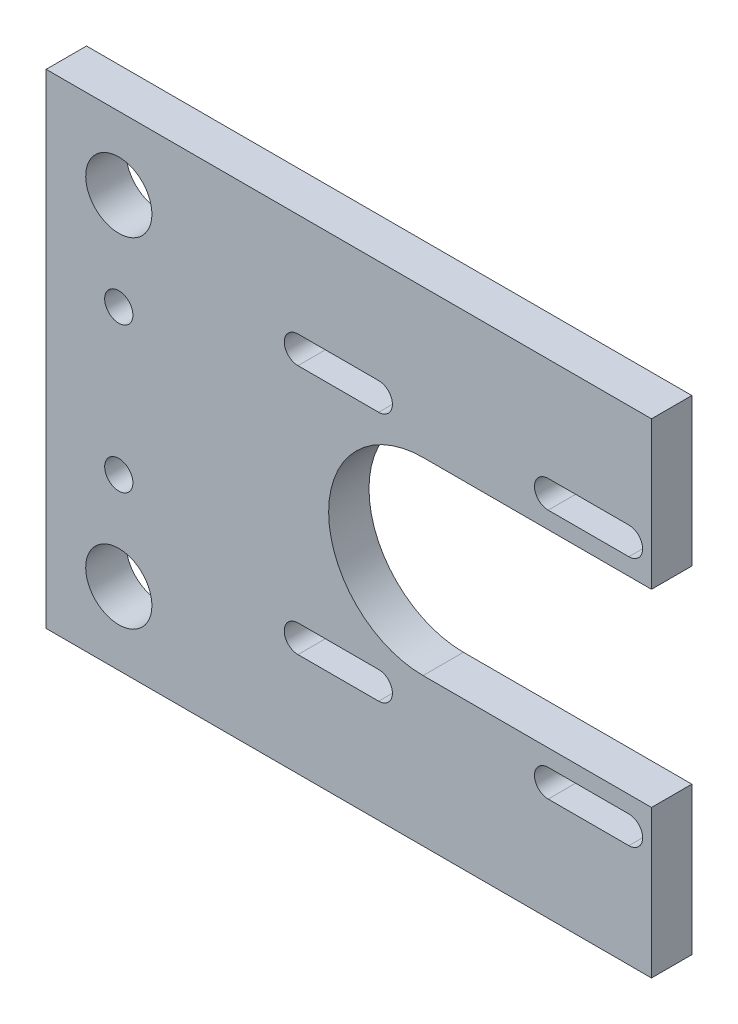
ISO-10303-21;
HEADER;
FILE_DESCRIPTION(('STEP AP214'),'2;1');
FILE_NAME('part.step','',(''),(''),'','','');
FILE_SCHEMA(('AUTOMOTIVE_DESIGN { 1 0 10303 214 1 1 1 1 }'));
ENDSEC;
DATA;
#1=APPLICATION_CONTEXT('core data for automotive mechanical design processes');
#2=APPLICATION_PROTOCOL_DEFINITION('international standard','automotive_design',2000,#1);
#3=PRODUCT_CONTEXT('',#1,'mechanical');
#4=PRODUCT('Part','Part','',(#3));
#5=PRODUCT_RELATED_PRODUCT_CATEGORY('part','',(#4));
#6=PRODUCT_DEFINITION_FORMATION('','',#4);
#7=PRODUCT_DEFINITION_CONTEXT('part definition',#1,'design');
#8=PRODUCT_DEFINITION('design','',#6,#7);
#9=PRODUCT_DEFINITION_SHAPE('','',#8);
#10=(LENGTH_UNIT() NAMED_UNIT(*) SI_UNIT(.MILLI.,.METRE.));
#11=(NAMED_UNIT(*) PLANE_ANGLE_UNIT() SI_UNIT($,.RADIAN.));
#12=(NAMED_UNIT(*) SI_UNIT($,.STERADIAN.) SOLID_ANGLE_UNIT());
#13=UNCERTAINTY_MEASURE_WITH_UNIT(LENGTH_MEASURE(1.E-05),#10,'distance_accuracy_value','');
#14=(GEOMETRIC_REPRESENTATION_CONTEXT(3) GLOBAL_UNCERTAINTY_ASSIGNED_CONTEXT((#13)) GLOBAL_UNIT_ASSIGNED_CONTEXT((#10,
#11,#12)) REPRESENTATION_CONTEXT('',''));
#15=CARTESIAN_POINT('',(0.,0.,0.));
#16=DIRECTION('',(0.,0.,1.));
#17=DIRECTION('',(1.,0.,0.));
#18=AXIS2_PLACEMENT_3D('',#15,#16,#17);
#19=CARTESIAN_POINT('',(55.,-31.7446168534772,38.6073043374941));
#20=DIRECTION('',(1.,0.,0.));
#21=DIRECTION('',(0.,0.,-1.));
#22=AXIS2_PLACEMENT_3D('',#19,#20,#21);
#23=PLANE('',#22);
#24=DIRECTION('',(0.,0.,-1.));
#25=VECTOR('',#24,1.);
#26=CARTESIAN_POINT('',(55.,-13.4446168534772,38.6073043374941));
#27=LINE('',#26,#25);
#28=CARTESIAN_POINT('',(55.,-13.4446168534772,38.6073043374942));
#29=VERTEX_POINT('',#28);
#30=CARTESIAN_POINT('',(55.,-13.4446168534772,33.6073043374942));
#31=VERTEX_POINT('',#30);
#32=EDGE_CURVE('E11',#29,#31,#27,.T.);
#33=ORIENTED_EDGE('',*,*,#32,.F.);
#34=DIRECTION('',(0.,-1.,0.));
#35=VECTOR('',#34,1.);
#36=CARTESIAN_POINT('',(55.,28.2553831465228,38.6073043374942));
#37=LINE('',#36,#35);
#38=CARTESIAN_POINT('',(55.,-31.7446168534772,38.6073043374941));
#39=VERTEX_POINT('',#38);
#40=EDGE_CURVE('E377',#29,#39,#37,.T.);
#41=ORIENTED_EDGE('',*,*,#40,.T.);
#42=DIRECTION('',(0.,0.,-1.));
#43=VECTOR('',#42,1.);
#44=CARTESIAN_POINT('',(55.,-31.7446168534772,38.6073043374941));
#45=LINE('',#44,#43);
#46=CARTESIAN_POINT('',(55.,-31.7446168534772,33.6073043374941));
#47=VERTEX_POINT('',#46);
#48=EDGE_CURVE('E382',#39,#47,#45,.T.);
#49=ORIENTED_EDGE('',*,*,#48,.T.);
#50=DIRECTION('',(0.,1.,0.));
#51=VECTOR('',#50,1.);
#52=CARTESIAN_POINT('',(55.,28.2553831465228,33.6073043374941));
#53=LINE('',#52,#51);
#54=EDGE_CURVE('E204',#47,#31,#53,.T.);
#55=ORIENTED_EDGE('',*,*,#54,.T.);
#56=EDGE_LOOP('',(#33,#41,#49,#55));
#57=FACE_BOUND('',#56,.T.);
#58=ADVANCED_FACE('F35',(#57),#23,.T.);
#59=CARTESIAN_POINT('',(5.,28.2553831465228,38.6073043374942));
#60=DIRECTION('',(0.,0.,-1.));
#61=DIRECTION('',(0.,1.,0.));
#62=AXIS2_PLACEMENT_3D('',#59,#60,#61);
#63=PLANE('',#62);
#64=CARTESIAN_POINT('',(-11.,7.25538314652282,38.6073043374942));
#65=DIRECTION('',(0.,0.,-1.));
#66=DIRECTION('',(0.,1.,0.));
#67=AXIS2_PLACEMENT_3D('',#64,#65,#66);
#68=CIRCLE('',#67,1.75);
#69=CARTESIAN_POINT('',(-11.,9.00538314652282,38.6073043374942));
#70=VERTEX_POINT('',#69);
#71=EDGE_CURVE('E719',#70,#70,#68,.T.);
#72=ORIENTED_EDGE('',*,*,#71,.T.);
#73=EDGE_LOOP('',(#72));
#74=FACE_BOUND('',#73,.T.);
#75=CARTESIAN_POINT('',(-11.,-10.7446168534772,38.6073043374942));
#76=DIRECTION('',(0.,0.,-1.));
#77=DIRECTION('',(0.,1.,0.));
#78=AXIS2_PLACEMENT_3D('',#75,#76,#77);
#79=CIRCLE('',#78,1.75);
#80=CARTESIAN_POINT('',(-11.,-8.99461685347718,38.6073043374942));
#81=VERTEX_POINT('',#80);
#82=EDGE_CURVE('E727',#81,#81,#79,.T.);
#83=ORIENTED_EDGE('',*,*,#82,.T.);
#84=EDGE_LOOP('',(#83));
#85=FACE_BOUND('',#84,.T.);
#86=CARTESIAN_POINT('',(-11.,-22.7446168534772,38.6073043374942));
#87=DIRECTION('',(0.,0.,-1.));
#88=DIRECTION('',(0.,1.,0.));
#89=AXIS2_PLACEMENT_3D('',#86,#87,#88);
#90=CIRCLE('',#89,4.1);
#91=CARTESIAN_POINT('',(-11.,-18.6446168534772,38.6073043374942));
#92=VERTEX_POINT('',#91);
#93=EDGE_CURVE('E733',#92,#92,#90,.T.);
#94=ORIENTED_EDGE('',*,*,#93,.T.);
#95=EDGE_LOOP('',(#94));
#96=FACE_BOUND('',#95,.T.);
#97=CARTESIAN_POINT('',(-11.,19.2553831465228,38.6073043374942));
#98=DIRECTION('',(0.,0.,-1.));
#99=DIRECTION('',(0.,1.,0.));
#100=AXIS2_PLACEMENT_3D('',#97,#98,#99);
#101=CIRCLE('',#100,4.1);
#102=CARTESIAN_POINT('',(-11.,23.3553831465228,38.6073043374942));
#103=VERTEX_POINT('',#102);
#104=EDGE_CURVE('E224',#103,#103,#101,.T.);
#105=ORIENTED_EDGE('',*,*,#104,.T.);
#106=EDGE_LOOP('',(#105));
#107=FACE_BOUND('',#106,.T.);
#108=DIRECTION('',(-1.,0.,0.));
#109=VECTOR('',#108,1.);
#110=CARTESIAN_POINT('',(11.2,12.0553831465228,38.6073043374942));
#111=LINE('',#110,#109);
#112=CARTESIAN_POINT('',(21.2,12.0553831465228,38.6073043374942));
#113=VERTEX_POINT('',#112);
#114=CARTESIAN_POINT('',(11.2,12.0553831465228,38.6073043374942));
#115=VERTEX_POINT('',#114);
#116=EDGE_CURVE('E241',#113,#115,#111,.T.);
#117=ORIENTED_EDGE('',*,*,#116,.T.);
#118=CARTESIAN_POINT('',(11.2,13.7553831465228,38.6073043374942));
#119=DIRECTION('',(0.,0.,-1.));
#120=DIRECTION('',(-1.,0.,0.));
#121=AXIS2_PLACEMENT_3D('',#118,#119,#120);
#122=CIRCLE('',#121,1.7);
#123=CARTESIAN_POINT('',(11.2,15.4553831465228,38.6073043374942));
#124=VERTEX_POINT('',#123);
#125=EDGE_CURVE('E233',#115,#124,#122,.T.);
#126=ORIENTED_EDGE('',*,*,#125,.T.);
#127=DIRECTION('',(1.,0.,0.));
#128=VECTOR('',#127,1.);
#129=CARTESIAN_POINT('',(11.2,15.4553831465228,38.6073043374942));
#130=LINE('',#129,#128);
#131=CARTESIAN_POINT('',(21.2,15.4553831465228,38.6073043374942));
#132=VERTEX_POINT('',#131);
#133=EDGE_CURVE('E236',#124,#132,#130,.T.);
#134=ORIENTED_EDGE('',*,*,#133,.T.);
#135=CARTESIAN_POINT('',(21.2,13.7553831465228,38.6073043374942));
#136=DIRECTION('',(0.,0.,-1.));
#137=DIRECTION('',(-1.,0.,0.));
#138=AXIS2_PLACEMENT_3D('',#135,#136,#137);
#139=CIRCLE('',#138,1.7);
#140=EDGE_CURVE('E50',#132,#113,#139,.T.);
#141=ORIENTED_EDGE('',*,*,#140,.T.);
#142=EDGE_LOOP('',(#117,#126,#134,#141));
#143=FACE_BOUND('',#142,.T.);
#144=DIRECTION('',(-1.,0.,0.));
#145=VECTOR('',#144,1.);
#146=CARTESIAN_POINT('',(11.2,-18.9446168534772,38.6073043374942));
#147=LINE('',#146,#145);
#148=CARTESIAN_POINT('',(21.2,-18.9446168534772,38.6073043374942));
#149=VERTEX_POINT('',#148);
#150=CARTESIAN_POINT('',(11.2,-18.9446168534772,38.6073043374942));
#151=VERTEX_POINT('',#150);
#152=EDGE_CURVE('E272',#149,#151,#147,.T.);
#153=ORIENTED_EDGE('',*,*,#152,.T.);
#154=CARTESIAN_POINT('',(11.2,-17.2446168534772,38.6073043374942));
#155=DIRECTION('',(0.,0.,-1.));
#156=DIRECTION('',(-1.,0.,0.));
#157=AXIS2_PLACEMENT_3D('',#154,#155,#156);
#158=CIRCLE('',#157,1.69999999999999);
#159=CARTESIAN_POINT('',(11.2,-15.5446168534772,38.6073043374942));
#160=VERTEX_POINT('',#159);
#161=EDGE_CURVE('E262',#151,#160,#158,.T.);
#162=ORIENTED_EDGE('',*,*,#161,.T.);
#163=DIRECTION('',(1.,0.,0.));
#164=VECTOR('',#163,1.);
#165=CARTESIAN_POINT('',(11.2,-15.5446168534772,38.6073043374942));
#166=LINE('',#165,#164);
#167=CARTESIAN_POINT('',(21.2,-15.5446168534772,38.6073043374941));
#168=VERTEX_POINT('',#167);
#169=EDGE_CURVE('E265',#160,#168,#166,.T.);
#170=ORIENTED_EDGE('',*,*,#169,.T.);
#171=CARTESIAN_POINT('',(21.2,-17.2446168534772,38.6073043374942));
#172=DIRECTION('',(0.,0.,-1.));
#173=DIRECTION('',(-1.,0.,0.));
#174=AXIS2_PLACEMENT_3D('',#171,#172,#173);
#175=CIRCLE('',#174,1.69999999999999);
#176=EDGE_CURVE('E269',#168,#149,#175,.T.);
#177=ORIENTED_EDGE('',*,*,#176,.T.);
#178=EDGE_LOOP('',(#153,#162,#170,#177));
#179=FACE_BOUND('',#178,.T.);
#180=DIRECTION('',(-1.,0.,0.));
#181=VECTOR('',#180,1.);
#182=CARTESIAN_POINT('',(42.2,-18.9446168534772,38.6073043374942));
#183=LINE('',#182,#181);
#184=CARTESIAN_POINT('',(52.2,-18.9446168534772,38.6073043374942));
#185=VERTEX_POINT('',#184);
#186=CARTESIAN_POINT('',(42.2,-18.9446168534772,38.6073043374942));
#187=VERTEX_POINT('',#186);
#188=EDGE_CURVE('E304',#185,#187,#183,.T.);
#189=ORIENTED_EDGE('',*,*,#188,.T.);
#190=CARTESIAN_POINT('',(42.2,-17.2446168534772,38.6073043374942));
#191=DIRECTION('',(0.,0.,-1.));
#192=DIRECTION('',(-1.,0.,0.));
#193=AXIS2_PLACEMENT_3D('',#190,#191,#192);
#194=CIRCLE('',#193,1.7);
#195=CARTESIAN_POINT('',(42.2,-15.5446168534772,38.6073043374942));
#196=VERTEX_POINT('',#195);
#197=EDGE_CURVE('E294',#187,#196,#194,.T.);
#198=ORIENTED_EDGE('',*,*,#197,.T.);
#199=DIRECTION('',(1.,0.,0.));
#200=VECTOR('',#199,1.);
#201=CARTESIAN_POINT('',(42.2,-15.5446168534772,38.6073043374942));
#202=LINE('',#201,#200);
#203=CARTESIAN_POINT('',(52.2,-15.5446168534772,38.6073043374941));
#204=VERTEX_POINT('',#203);
#205=EDGE_CURVE('E297',#196,#204,#202,.T.);
#206=ORIENTED_EDGE('',*,*,#205,.T.);
#207=CARTESIAN_POINT('',(52.2,-17.2446168534772,38.6073043374942));
#208=DIRECTION('',(0.,0.,-1.));
#209=DIRECTION('',(-1.,0.,0.));
#210=AXIS2_PLACEMENT_3D('',#207,#208,#209);
#211=CIRCLE('',#210,1.7);
#212=EDGE_CURVE('E301',#204,#185,#211,.T.);
#213=ORIENTED_EDGE('',*,*,#212,.T.);
#214=EDGE_LOOP('',(#189,#198,#206,#213));
#215=FACE_BOUND('',#214,.T.);
#216=DIRECTION('',(-1.,0.,0.));
#217=VECTOR('',#216,1.);
#218=CARTESIAN_POINT('',(42.2,12.0553831465228,38.6073043374942));
#219=LINE('',#218,#217);
#220=CARTESIAN_POINT('',(52.2,12.0553831465228,38.6073043374942));
#221=VERTEX_POINT('',#220);
#222=CARTESIAN_POINT('',(42.2,12.0553831465228,38.6073043374942));
#223=VERTEX_POINT('',#222);
#224=EDGE_CURVE('E336',#221,#223,#219,.T.);
#225=ORIENTED_EDGE('',*,*,#224,.T.);
#226=CARTESIAN_POINT('',(42.2,13.7553831465228,38.6073043374942));
#227=DIRECTION('',(0.,0.,-1.));
#228=DIRECTION('',(-1.,0.,0.));
#229=AXIS2_PLACEMENT_3D('',#226,#227,#228);
#230=CIRCLE('',#229,1.7);
#231=CARTESIAN_POINT('',(42.2,15.4553831465228,38.6073043374942));
#232=VERTEX_POINT('',#231);
#233=EDGE_CURVE('E326',#223,#232,#230,.T.);
#234=ORIENTED_EDGE('',*,*,#233,.T.);
#235=DIRECTION('',(1.,0.,0.));
#236=VECTOR('',#235,1.);
#237=CARTESIAN_POINT('',(42.2,15.4553831465228,38.6073043374942));
#238=LINE('',#237,#236);
#239=CARTESIAN_POINT('',(52.2,15.4553831465228,38.6073043374942));
#240=VERTEX_POINT('',#239);
#241=EDGE_CURVE('E329',#232,#240,#238,.T.);
#242=ORIENTED_EDGE('',*,*,#241,.T.);
#243=CARTESIAN_POINT('',(52.2,13.7553831465228,38.6073043374942));
#244=DIRECTION('',(0.,0.,-1.));
#245=DIRECTION('',(-1.,0.,0.));
#246=AXIS2_PLACEMENT_3D('',#243,#244,#245);
#247=CIRCLE('',#246,1.69999999999999);
#248=EDGE_CURVE('E333',#240,#221,#247,.T.);
#249=ORIENTED_EDGE('',*,*,#248,.T.);
#250=EDGE_LOOP('',(#225,#234,#242,#249));
#251=FACE_BOUND('',#250,.T.);
#252=ORIENTED_EDGE('',*,*,#40,.F.);
#253=DIRECTION('',(-1.,0.,0.));
#254=VECTOR('',#253,1.);
#255=CARTESIAN_POINT('',(26.7,-13.4446168534772,38.6073043374942));
#256=LINE('',#255,#254);
#257=CARTESIAN_POINT('',(26.7,-13.4446168534772,38.6073043374942));
#258=VERTEX_POINT('',#257);
#259=EDGE_CURVE('E365',#29,#258,#256,.T.);
#260=ORIENTED_EDGE('',*,*,#259,.T.);
#261=CARTESIAN_POINT('',(26.7,-1.74461685347718,38.6073043374942));
#262=DIRECTION('',(0.,0.,-1.));
#263=DIRECTION('',(-1.,0.,0.));
#264=AXIS2_PLACEMENT_3D('',#261,#262,#263);
#265=CIRCLE('',#264,11.7);
#266=CARTESIAN_POINT('',(26.7,9.95538314652282,38.6073043374942));
#267=VERTEX_POINT('',#266);
#268=EDGE_CURVE('E358',#258,#267,#265,.T.);
#269=ORIENTED_EDGE('',*,*,#268,.T.);
#270=DIRECTION('',(1.,0.,0.));
#271=VECTOR('',#270,1.);
#272=CARTESIAN_POINT('',(26.7,9.95538314652282,38.6073043374942));
#273=LINE('',#272,#271);
#274=CARTESIAN_POINT('',(55.,9.95538314652282,38.6073043374942));
#275=VERTEX_POINT('',#274);
#276=EDGE_CURVE('E361',#267,#275,#273,.T.);
#277=ORIENTED_EDGE('',*,*,#276,.T.);
#278=CARTESIAN_POINT('',(55.,28.2553831465228,38.6073043374942));
#279=VERTEX_POINT('',#278);
#280=EDGE_CURVE('E379',#279,#275,#37,.T.);
#281=ORIENTED_EDGE('',*,*,#280,.F.);
#282=DIRECTION('',(-1.,0.,0.));
#283=VECTOR('',#282,1.);
#284=CARTESIAN_POINT('',(5.,28.2553831465228,38.6073043374942));
#285=LINE('',#284,#283);
#286=CARTESIAN_POINT('',(-20.,28.2553831465228,38.6073043374941));
#287=VERTEX_POINT('',#286);
#288=EDGE_CURVE('E389',#279,#287,#285,.T.);
#289=ORIENTED_EDGE('',*,*,#288,.T.);
#290=DIRECTION('',(0.,1.,0.));
#291=VECTOR('',#290,1.);
#292=CARTESIAN_POINT('',(-20.,28.2553831465228,38.6073043374941));
#293=LINE('',#292,#291);
#294=CARTESIAN_POINT('',(-20.,-31.7446168534772,38.6073043374941));
#295=VERTEX_POINT('',#294);
#296=EDGE_CURVE('E218',#295,#287,#293,.T.);
#297=ORIENTED_EDGE('',*,*,#296,.F.);
#298=DIRECTION('',(-1.,0.,0.));
#299=VECTOR('',#298,1.);
#300=CARTESIAN_POINT('',(5.,-31.7446168534772,38.6073043374941));
#301=LINE('',#300,#299);
#302=EDGE_CURVE('E208',#39,#295,#301,.T.);
#303=ORIENTED_EDGE('',*,*,#302,.F.);
#304=EDGE_LOOP('',(#252,#260,#269,#277,#281,#289,#297,#303));
#305=FACE_BOUND('',#304,.T.);
#306=ADVANCED_FACE('F37',(#74,#85,#96,#107,#143,#179,#215,#251,#305),#63,.F.);
#307=CARTESIAN_POINT('',(5.,-31.7446168534772,38.6073043374941));
#308=DIRECTION('',(0.,1.,0.));
#309=DIRECTION('',(0.,0.,1.));
#310=AXIS2_PLACEMENT_3D('',#307,#308,#309);
#311=PLANE('',#310);
#312=ORIENTED_EDGE('',*,*,#302,.T.);
#313=DIRECTION('',(0.,0.,1.));
#314=VECTOR('',#313,1.);
#315=CARTESIAN_POINT('',(-20.,-31.7446168534772,33.6073043374942));
#316=LINE('',#315,#314);
#317=CARTESIAN_POINT('',(-20.,-31.7446168534772,33.6073043374942));
#318=VERTEX_POINT('',#317);
#319=EDGE_CURVE('E212',#318,#295,#316,.T.);
#320=ORIENTED_EDGE('',*,*,#319,.F.);
#321=DIRECTION('',(-1.,0.,0.));
#322=VECTOR('',#321,1.);
#323=CARTESIAN_POINT('',(5.,-31.7446168534772,33.6073043374941));
#324=LINE('',#323,#322);
#325=EDGE_CURVE('E195',#47,#318,#324,.T.);
#326=ORIENTED_EDGE('',*,*,#325,.F.);
#327=ORIENTED_EDGE('',*,*,#48,.F.);
#328=EDGE_LOOP('',(#312,#320,#326,#327));
#329=FACE_BOUND('',#328,.T.);
#330=ADVANCED_FACE('F213',(#329),#311,.F.);
#331=CARTESIAN_POINT('',(5.,28.2553831465228,33.6073043374942));
#332=DIRECTION('',(0.,0.,1.));
#333=DIRECTION('',(0.,-1.,0.));
#334=AXIS2_PLACEMENT_3D('',#331,#332,#333);
#335=PLANE('',#334);
#336=CARTESIAN_POINT('',(-11.,7.25538314652282,33.6073043374942));
#337=DIRECTION('',(0.,0.,-1.));
#338=DIRECTION('',(0.,1.,0.));
#339=AXIS2_PLACEMENT_3D('',#336,#337,#338);
#340=CIRCLE('',#339,1.75);
#341=CARTESIAN_POINT('',(-11.,9.00538314652282,33.6073043374942));
#342=VERTEX_POINT('',#341);
#343=EDGE_CURVE('E722',#342,#342,#340,.T.);
#344=ORIENTED_EDGE('',*,*,#343,.F.);
#345=EDGE_LOOP('',(#344));
#346=FACE_BOUND('',#345,.T.);
#347=CARTESIAN_POINT('',(-11.,-10.7446168534772,33.6073043374942));
#348=DIRECTION('',(0.,0.,-1.));
#349=DIRECTION('',(0.,1.,0.));
#350=AXIS2_PLACEMENT_3D('',#347,#348,#349);
#351=CIRCLE('',#350,1.75);
#352=CARTESIAN_POINT('',(-11.,-8.99461685347718,33.6073043374942));
#353=VERTEX_POINT('',#352);
#354=EDGE_CURVE('E724',#353,#353,#351,.T.);
#355=ORIENTED_EDGE('',*,*,#354,.F.);
#356=EDGE_LOOP('',(#355));
#357=FACE_BOUND('',#356,.T.);
#358=CARTESIAN_POINT('',(-11.,-22.7446168534772,33.6073043374942));
#359=DIRECTION('',(0.,0.,-1.));
#360=DIRECTION('',(0.,1.,0.));
#361=AXIS2_PLACEMENT_3D('',#358,#359,#360);
#362=CIRCLE('',#361,4.1);
#363=CARTESIAN_POINT('',(-11.,-18.6446168534772,33.6073043374942));
#364=VERTEX_POINT('',#363);
#365=EDGE_CURVE('E730',#364,#364,#362,.T.);
#366=ORIENTED_EDGE('',*,*,#365,.F.);
#367=EDGE_LOOP('',(#366));
#368=FACE_BOUND('',#367,.T.);
#369=CARTESIAN_POINT('',(-11.,19.2553831465228,33.6073043374942));
#370=DIRECTION('',(0.,0.,-1.));
#371=DIRECTION('',(0.,1.,0.));
#372=AXIS2_PLACEMENT_3D('',#369,#370,#371);
#373=CIRCLE('',#372,4.1);
#374=CARTESIAN_POINT('',(-11.,23.3553831465228,33.6073043374942));
#375=VERTEX_POINT('',#374);
#376=EDGE_CURVE('E227',#375,#375,#373,.T.);
#377=ORIENTED_EDGE('',*,*,#376,.F.);
#378=EDGE_LOOP('',(#377));
#379=FACE_BOUND('',#378,.T.);
#380=DIRECTION('',(1.,0.,0.));
#381=VECTOR('',#380,1.);
#382=CARTESIAN_POINT('',(11.2,15.4553831465228,33.6073043374942));
#383=LINE('',#382,#381);
#384=CARTESIAN_POINT('',(11.2,15.4553831465228,33.6073043374942));
#385=VERTEX_POINT('',#384);
#386=CARTESIAN_POINT('',(21.2,15.4553831465228,33.6073043374942));
#387=VERTEX_POINT('',#386);
#388=EDGE_CURVE('E246',#385,#387,#383,.T.);
#389=ORIENTED_EDGE('',*,*,#388,.F.);
#390=CARTESIAN_POINT('',(11.2,13.7553831465228,33.6073043374942));
#391=DIRECTION('',(0.,0.,-1.));
#392=DIRECTION('',(-1.,0.,0.));
#393=AXIS2_PLACEMENT_3D('',#390,#391,#392);
#394=CIRCLE('',#393,1.7);
#395=CARTESIAN_POINT('',(11.2,12.0553831465228,33.6073043374942));
#396=VERTEX_POINT('',#395);
#397=EDGE_CURVE('E58',#396,#385,#394,.T.);
#398=ORIENTED_EDGE('',*,*,#397,.F.);
#399=DIRECTION('',(-1.,0.,0.));
#400=VECTOR('',#399,1.);
#401=CARTESIAN_POINT('',(11.2,12.0553831465228,33.6073043374942));
#402=LINE('',#401,#400);
#403=CARTESIAN_POINT('',(21.2,12.0553831465228,33.6073043374942));
#404=VERTEX_POINT('',#403);
#405=EDGE_CURVE('E237',#404,#396,#402,.T.);
#406=ORIENTED_EDGE('',*,*,#405,.F.);
#407=CARTESIAN_POINT('',(21.2,13.7553831465228,33.6073043374942));
#408=DIRECTION('',(0.,0.,-1.));
#409=DIRECTION('',(-1.,0.,0.));
#410=AXIS2_PLACEMENT_3D('',#407,#408,#409);
#411=CIRCLE('',#410,1.7);
#412=EDGE_CURVE('E249',#387,#404,#411,.T.);
#413=ORIENTED_EDGE('',*,*,#412,.F.);
#414=EDGE_LOOP('',(#389,#398,#406,#413));
#415=FACE_BOUND('',#414,.T.);
#416=DIRECTION('',(1.,0.,0.));
#417=VECTOR('',#416,1.);
#418=CARTESIAN_POINT('',(11.2,-15.5446168534772,33.6073043374942));
#419=LINE('',#418,#417);
#420=CARTESIAN_POINT('',(11.2,-15.5446168534772,33.6073043374941));
#421=VERTEX_POINT('',#420);
#422=CARTESIAN_POINT('',(21.2,-15.5446168534772,33.6073043374942));
#423=VERTEX_POINT('',#422);
#424=EDGE_CURVE('E277',#421,#423,#419,.T.);
#425=ORIENTED_EDGE('',*,*,#424,.F.);
#426=CARTESIAN_POINT('',(11.2,-17.2446168534772,33.6073043374942));
#427=DIRECTION('',(0.,0.,-1.));
#428=DIRECTION('',(-1.,0.,0.));
#429=AXIS2_PLACEMENT_3D('',#426,#427,#428);
#430=CIRCLE('',#429,1.69999999999999);
#431=CARTESIAN_POINT('',(11.2,-18.9446168534772,33.6073043374942));
#432=VERTEX_POINT('',#431);
#433=EDGE_CURVE('E256',#432,#421,#430,.T.);
#434=ORIENTED_EDGE('',*,*,#433,.F.);
#435=DIRECTION('',(-1.,0.,0.));
#436=VECTOR('',#435,1.);
#437=CARTESIAN_POINT('',(11.2,-18.9446168534772,33.6073043374942));
#438=LINE('',#437,#436);
#439=CARTESIAN_POINT('',(21.2,-18.9446168534772,33.6073043374942));
#440=VERTEX_POINT('',#439);
#441=EDGE_CURVE('E266',#440,#432,#438,.T.);
#442=ORIENTED_EDGE('',*,*,#441,.F.);
#443=CARTESIAN_POINT('',(21.2,-17.2446168534772,33.6073043374942));
#444=DIRECTION('',(0.,0.,-1.));
#445=DIRECTION('',(-1.,0.,0.));
#446=AXIS2_PLACEMENT_3D('',#443,#444,#445);
#447=CIRCLE('',#446,1.69999999999999);
#448=EDGE_CURVE('E280',#423,#440,#447,.T.);
#449=ORIENTED_EDGE('',*,*,#448,.F.);
#450=EDGE_LOOP('',(#425,#434,#442,#449));
#451=FACE_BOUND('',#450,.T.);
#452=DIRECTION('',(1.,0.,0.));
#453=VECTOR('',#452,1.);
#454=CARTESIAN_POINT('',(42.2,-15.5446168534772,33.6073043374942));
#455=LINE('',#454,#453);
#456=CARTESIAN_POINT('',(42.2,-15.5446168534772,33.6073043374941));
#457=VERTEX_POINT('',#456);
#458=CARTESIAN_POINT('',(52.2,-15.5446168534772,33.6073043374942));
#459=VERTEX_POINT('',#458);
#460=EDGE_CURVE('E309',#457,#459,#455,.T.);
#461=ORIENTED_EDGE('',*,*,#460,.F.);
#462=CARTESIAN_POINT('',(42.2,-17.2446168534772,33.6073043374942));
#463=DIRECTION('',(0.,0.,-1.));
#464=DIRECTION('',(-1.,0.,0.));
#465=AXIS2_PLACEMENT_3D('',#462,#463,#464);
#466=CIRCLE('',#465,1.7);
#467=CARTESIAN_POINT('',(42.2,-18.9446168534772,33.6073043374942));
#468=VERTEX_POINT('',#467);
#469=EDGE_CURVE('E287',#468,#457,#466,.T.);
#470=ORIENTED_EDGE('',*,*,#469,.F.);
#471=DIRECTION('',(-1.,0.,0.));
#472=VECTOR('',#471,1.);
#473=CARTESIAN_POINT('',(42.2,-18.9446168534772,33.6073043374942));
#474=LINE('',#473,#472);
#475=CARTESIAN_POINT('',(52.2,-18.9446168534772,33.6073043374942));
#476=VERTEX_POINT('',#475);
#477=EDGE_CURVE('E298',#476,#468,#474,.T.);
#478=ORIENTED_EDGE('',*,*,#477,.F.);
#479=CARTESIAN_POINT('',(52.2,-17.2446168534772,33.6073043374942));
#480=DIRECTION('',(0.,0.,-1.));
#481=DIRECTION('',(-1.,0.,0.));
#482=AXIS2_PLACEMENT_3D('',#479,#480,#481);
#483=CIRCLE('',#482,1.7);
#484=EDGE_CURVE('E312',#459,#476,#483,.T.);
#485=ORIENTED_EDGE('',*,*,#484,.F.);
#486=EDGE_LOOP('',(#461,#470,#478,#485));
#487=FACE_BOUND('',#486,.T.);
#488=DIRECTION('',(1.,0.,0.));
#489=VECTOR('',#488,1.);
#490=CARTESIAN_POINT('',(42.2,15.4553831465228,33.6073043374942));
#491=LINE('',#490,#489);
#492=CARTESIAN_POINT('',(42.2,15.4553831465228,33.6073043374942));
#493=VERTEX_POINT('',#492);
#494=CARTESIAN_POINT('',(52.2,15.4553831465228,33.6073043374942));
#495=VERTEX_POINT('',#494);
#496=EDGE_CURVE('E341',#493,#495,#491,.T.);
#497=ORIENTED_EDGE('',*,*,#496,.F.);
#498=CARTESIAN_POINT('',(42.2,13.7553831465228,33.6073043374942));
#499=DIRECTION('',(0.,0.,-1.));
#500=DIRECTION('',(-1.,0.,0.));
#501=AXIS2_PLACEMENT_3D('',#498,#499,#500);
#502=CIRCLE('',#501,1.7);
#503=CARTESIAN_POINT('',(42.2,12.0553831465228,33.6073043374942));
#504=VERTEX_POINT('',#503);
#505=EDGE_CURVE('E319',#504,#493,#502,.T.);
#506=ORIENTED_EDGE('',*,*,#505,.F.);
#507=DIRECTION('',(-1.,0.,0.));
#508=VECTOR('',#507,1.);
#509=CARTESIAN_POINT('',(42.2,12.0553831465228,33.6073043374942));
#510=LINE('',#509,#508);
#511=CARTESIAN_POINT('',(52.2,12.0553831465228,33.6073043374942));
#512=VERTEX_POINT('',#511);
#513=EDGE_CURVE('E330',#512,#504,#510,.T.);
#514=ORIENTED_EDGE('',*,*,#513,.F.);
#515=CARTESIAN_POINT('',(52.2,13.7553831465228,33.6073043374942));
#516=DIRECTION('',(0.,0.,-1.));
#517=DIRECTION('',(-1.,0.,0.));
#518=AXIS2_PLACEMENT_3D('',#515,#516,#517);
#519=CIRCLE('',#518,1.69999999999999);
#520=EDGE_CURVE('E344',#495,#512,#519,.T.);
#521=ORIENTED_EDGE('',*,*,#520,.F.);
#522=EDGE_LOOP('',(#497,#506,#514,#521));
#523=FACE_BOUND('',#522,.T.);
#524=CARTESIAN_POINT('',(26.7,-1.74461685347718,33.6073043374942));
#525=DIRECTION('',(0.,0.,-1.));
#526=DIRECTION('',(-1.,0.,0.));
#527=AXIS2_PLACEMENT_3D('',#524,#525,#526);
#528=CIRCLE('',#527,11.7);
#529=CARTESIAN_POINT('',(26.7,-13.4446168534772,33.6073043374942));
#530=VERTEX_POINT('',#529);
#531=CARTESIAN_POINT('',(26.7,9.95538314652282,33.6073043374942));
#532=VERTEX_POINT('',#531);
#533=EDGE_CURVE('E351',#530,#532,#528,.T.);
#534=ORIENTED_EDGE('',*,*,#533,.F.);
#535=DIRECTION('',(-1.,0.,0.));
#536=VECTOR('',#535,1.);
#537=CARTESIAN_POINT('',(26.7,-13.4446168534772,33.6073043374942));
#538=LINE('',#537,#536);
#539=EDGE_CURVE('E362',#31,#530,#538,.T.);
#540=ORIENTED_EDGE('',*,*,#539,.F.);
#541=ORIENTED_EDGE('',*,*,#54,.F.);
#542=ORIENTED_EDGE('',*,*,#325,.T.);
#543=DIRECTION('',(0.,-1.,0.));
#544=VECTOR('',#543,1.);
#545=CARTESIAN_POINT('',(-20.,28.2553831465228,33.6073043374942));
#546=LINE('',#545,#544);
#547=CARTESIAN_POINT('',(-20.,28.2553831465228,33.6073043374942));
#548=VERTEX_POINT('',#547);
#549=EDGE_CURVE('E201',#548,#318,#546,.T.);
#550=ORIENTED_EDGE('',*,*,#549,.F.);
#551=DIRECTION('',(-1.,0.,0.));
#552=VECTOR('',#551,1.);
#553=CARTESIAN_POINT('',(5.,28.2553831465228,33.6073043374942));
#554=LINE('',#553,#552);
#555=CARTESIAN_POINT('',(55.,28.2553831465228,33.6073043374941));
#556=VERTEX_POINT('',#555);
#557=EDGE_CURVE('E209',#556,#548,#554,.T.);
#558=ORIENTED_EDGE('',*,*,#557,.F.);
#559=CARTESIAN_POINT('',(55.,9.95538314652283,33.6073043374941));
#560=VERTEX_POINT('',#559);
#561=EDGE_CURVE('E384',#560,#556,#53,.T.);
#562=ORIENTED_EDGE('',*,*,#561,.F.);
#563=DIRECTION('',(1.,0.,0.));
#564=VECTOR('',#563,1.);
#565=CARTESIAN_POINT('',(26.7,9.95538314652282,33.6073043374942));
#566=LINE('',#565,#564);
#567=EDGE_CURVE('E371',#532,#560,#566,.T.);
#568=ORIENTED_EDGE('',*,*,#567,.F.);
#569=EDGE_LOOP('',(#534,#540,#541,#542,#550,#558,#562,#568));
#570=FACE_BOUND('',#569,.T.);
#571=ADVANCED_FACE('F198',(#346,#357,#368,#379,#415,#451,#487,#523,#570),#335,.F.);
#572=CARTESIAN_POINT('',(5.,28.2553831465228,38.6073043374942));
#573=DIRECTION('',(0.,-1.,0.));
#574=DIRECTION('',(0.,0.,-1.));
#575=AXIS2_PLACEMENT_3D('',#572,#573,#574);
#576=PLANE('',#575);
#577=ORIENTED_EDGE('',*,*,#557,.T.);
#578=DIRECTION('',(0.,0.,-1.));
#579=VECTOR('',#578,1.);
#580=CARTESIAN_POINT('',(-20.,28.2553831465228,33.6073043374942));
#581=LINE('',#580,#579);
#582=EDGE_CURVE('E223',#287,#548,#581,.T.);
#583=ORIENTED_EDGE('',*,*,#582,.F.);
#584=ORIENTED_EDGE('',*,*,#288,.F.);
#585=DIRECTION('',(0.,0.,1.));
#586=VECTOR('',#585,1.);
#587=CARTESIAN_POINT('',(55.,28.2553831465228,38.6073043374942));
#588=LINE('',#587,#586);
#589=EDGE_CURVE('E386',#556,#279,#588,.T.);
#590=ORIENTED_EDGE('',*,*,#589,.F.);
#591=EDGE_LOOP('',(#577,#583,#584,#590));
#592=FACE_BOUND('',#591,.T.);
#593=ADVANCED_FACE('F406',(#592),#576,.F.);
#594=DIRECTION('',(0.,0.,1.));
#595=VECTOR('',#594,1.);
#596=CARTESIAN_POINT('',(55.,9.95538314652282,38.6073043374941));
#597=LINE('',#596,#595);
#598=EDGE_CURVE('E43',#560,#275,#597,.T.);
#599=ORIENTED_EDGE('',*,*,#598,.F.);
#600=ORIENTED_EDGE('',*,*,#561,.T.);
#601=ORIENTED_EDGE('',*,*,#589,.T.);
#602=ORIENTED_EDGE('',*,*,#280,.T.);
#603=EDGE_LOOP('',(#599,#600,#601,#602));
#604=FACE_BOUND('',#603,.T.);
#605=ADVANCED_FACE('F403',(#604),#23,.T.);
#606=CARTESIAN_POINT('',(26.7,-1.74461685347718,38.6073043374942));
#607=DIRECTION('',(0.,0.,-1.));
#608=DIRECTION('',(-1.,0.,0.));
#609=AXIS2_PLACEMENT_3D('',#606,#607,#608);
#610=CYLINDRICAL_SURFACE('',#609,11.7);
#611=ORIENTED_EDGE('',*,*,#533,.T.);
#612=DIRECTION('',(0.,0.,-1.));
#613=VECTOR('',#612,1.);
#614=CARTESIAN_POINT('',(26.7,9.95538314652282,38.6073043374942));
#615=LINE('',#614,#613);
#616=EDGE_CURVE('E368',#267,#532,#615,.T.);
#617=ORIENTED_EDGE('',*,*,#616,.F.);
#618=ORIENTED_EDGE('',*,*,#268,.F.);
#619=DIRECTION('',(0.,0.,-1.));
#620=VECTOR('',#619,1.);
#621=CARTESIAN_POINT('',(26.7,-13.4446168534772,38.6073043374942));
#622=LINE('',#621,#620);
#623=EDGE_CURVE('E374',#258,#530,#622,.T.);
#624=ORIENTED_EDGE('',*,*,#623,.T.);
#625=EDGE_LOOP('',(#611,#617,#618,#624));
#626=FACE_BOUND('',#625,.T.);
#627=ADVANCED_FACE('F412',(#626),#610,.F.);
#628=CARTESIAN_POINT('',(26.7,-13.4446168534772,38.6073043374942));
#629=DIRECTION('',(0.,-1.,0.));
#630=DIRECTION('',(1.,0.,0.));
#631=AXIS2_PLACEMENT_3D('',#628,#629,#630);
#632=PLANE('',#631);
#633=ORIENTED_EDGE('',*,*,#32,.T.);
#634=ORIENTED_EDGE('',*,*,#539,.T.);
#635=ORIENTED_EDGE('',*,*,#623,.F.);
#636=ORIENTED_EDGE('',*,*,#259,.F.);
#637=EDGE_LOOP('',(#633,#634,#635,#636));
#638=FACE_BOUND('',#637,.T.);
#639=ADVANCED_FACE('F410',(#638),#632,.F.);
#640=CARTESIAN_POINT('',(26.7,9.95538314652282,38.6073043374942));
#641=DIRECTION('',(0.,1.,0.));
#642=DIRECTION('',(-1.,0.,0.));
#643=AXIS2_PLACEMENT_3D('',#640,#641,#642);
#644=PLANE('',#643);
#645=ORIENTED_EDGE('',*,*,#598,.T.);
#646=ORIENTED_EDGE('',*,*,#276,.F.);
#647=ORIENTED_EDGE('',*,*,#616,.T.);
#648=ORIENTED_EDGE('',*,*,#567,.T.);
#649=EDGE_LOOP('',(#645,#646,#647,#648));
#650=FACE_BOUND('',#649,.T.);
#651=ADVANCED_FACE('F395',(#650),#644,.F.);
#652=CARTESIAN_POINT('',(42.2,13.7553831465228,38.6073043374942));
#653=DIRECTION('',(0.,0.,-1.));
#654=DIRECTION('',(-1.,0.,0.));
#655=AXIS2_PLACEMENT_3D('',#652,#653,#654);
#656=CYLINDRICAL_SURFACE('',#655,1.7);
#657=ORIENTED_EDGE('',*,*,#505,.T.);
#658=DIRECTION('',(0.,0.,-1.));
#659=VECTOR('',#658,1.);
#660=CARTESIAN_POINT('',(42.2,15.4553831465228,38.6073043374942));
#661=LINE('',#660,#659);
#662=EDGE_CURVE('E339',#232,#493,#661,.T.);
#663=ORIENTED_EDGE('',*,*,#662,.F.);
#664=ORIENTED_EDGE('',*,*,#233,.F.);
#665=DIRECTION('',(0.,0.,-1.));
#666=VECTOR('',#665,1.);
#667=CARTESIAN_POINT('',(42.2,12.0553831465228,38.6073043374942));
#668=LINE('',#667,#666);
#669=EDGE_CURVE('E349',#223,#504,#668,.T.);
#670=ORIENTED_EDGE('',*,*,#669,.T.);
#671=EDGE_LOOP('',(#657,#663,#664,#670));
#672=FACE_BOUND('',#671,.T.);
#673=ADVANCED_FACE('F478',(#672),#656,.F.);
#674=CARTESIAN_POINT('',(42.2,12.0553831465228,38.6073043374942));
#675=DIRECTION('',(0.,-1.,0.));
#676=DIRECTION('',(1.,0.,0.));
#677=AXIS2_PLACEMENT_3D('',#674,#675,#676);
#678=PLANE('',#677);
#679=ORIENTED_EDGE('',*,*,#513,.T.);
#680=ORIENTED_EDGE('',*,*,#669,.F.);
#681=ORIENTED_EDGE('',*,*,#224,.F.);
#682=DIRECTION('',(0.,0.,-1.));
#683=VECTOR('',#682,1.);
#684=CARTESIAN_POINT('',(52.2,12.0553831465228,38.6073043374942));
#685=LINE('',#684,#683);
#686=EDGE_CURVE('E352',#221,#512,#685,.T.);
#687=ORIENTED_EDGE('',*,*,#686,.T.);
#688=EDGE_LOOP('',(#679,#680,#681,#687));
#689=FACE_BOUND('',#688,.T.);
#690=ADVANCED_FACE('F486',(#689),#678,.F.);
#691=CARTESIAN_POINT('',(52.2,13.7553831465228,38.6073043374942));
#692=DIRECTION('',(0.,0.,-1.));
#693=DIRECTION('',(-1.,0.,0.));
#694=AXIS2_PLACEMENT_3D('',#691,#692,#693);
#695=CYLINDRICAL_SURFACE('',#694,1.69999999999999);
#696=ORIENTED_EDGE('',*,*,#520,.T.);
#697=ORIENTED_EDGE('',*,*,#686,.F.);
#698=ORIENTED_EDGE('',*,*,#248,.F.);
#699=DIRECTION('',(0.,0.,-1.));
#700=VECTOR('',#699,1.);
#701=CARTESIAN_POINT('',(52.2,15.4553831465228,38.6073043374942));
#702=LINE('',#701,#700);
#703=EDGE_CURVE('E354',#240,#495,#702,.T.);
#704=ORIENTED_EDGE('',*,*,#703,.T.);
#705=EDGE_LOOP('',(#696,#697,#698,#704));
#706=FACE_BOUND('',#705,.T.);
#707=ADVANCED_FACE('F496',(#706),#695,.F.);
#708=CARTESIAN_POINT('',(42.2,15.4553831465228,38.6073043374942));
#709=DIRECTION('',(0.,1.,0.));
#710=DIRECTION('',(-1.,0.,0.));
#711=AXIS2_PLACEMENT_3D('',#708,#709,#710);
#712=PLANE('',#711);
#713=ORIENTED_EDGE('',*,*,#496,.T.);
#714=ORIENTED_EDGE('',*,*,#703,.F.);
#715=ORIENTED_EDGE('',*,*,#241,.F.);
#716=ORIENTED_EDGE('',*,*,#662,.T.);
#717=EDGE_LOOP('',(#713,#714,#715,#716));
#718=FACE_BOUND('',#717,.T.);
#719=ADVANCED_FACE('F506',(#718),#712,.F.);
#720=CARTESIAN_POINT('',(42.2,-17.2446168534772,38.6073043374942));
#721=DIRECTION('',(0.,0.,-1.));
#722=DIRECTION('',(-1.,0.,0.));
#723=AXIS2_PLACEMENT_3D('',#720,#721,#722);
#724=CYLINDRICAL_SURFACE('',#723,1.7);
#725=ORIENTED_EDGE('',*,*,#469,.T.);
#726=DIRECTION('',(0.,0.,-1.));
#727=VECTOR('',#726,1.);
#728=CARTESIAN_POINT('',(42.2,-15.5446168534772,38.6073043374942));
#729=LINE('',#728,#727);
#730=EDGE_CURVE('E307',#196,#457,#729,.T.);
#731=ORIENTED_EDGE('',*,*,#730,.F.);
#732=ORIENTED_EDGE('',*,*,#197,.F.);
#733=DIRECTION('',(0.,0.,-1.));
#734=VECTOR('',#733,1.);
#735=CARTESIAN_POINT('',(42.2,-18.9446168534772,38.6073043374942));
#736=LINE('',#735,#734);
#737=EDGE_CURVE('E317',#187,#468,#736,.T.);
#738=ORIENTED_EDGE('',*,*,#737,.T.);
#739=EDGE_LOOP('',(#725,#731,#732,#738));
#740=FACE_BOUND('',#739,.T.);
#741=ADVANCED_FACE('F516',(#740),#724,.F.);
#742=CARTESIAN_POINT('',(42.2,-18.9446168534772,38.6073043374942));
#743=DIRECTION('',(0.,-1.,0.));
#744=DIRECTION('',(1.,0.,0.));
#745=AXIS2_PLACEMENT_3D('',#742,#743,#744);
#746=PLANE('',#745);
#747=ORIENTED_EDGE('',*,*,#477,.T.);
#748=ORIENTED_EDGE('',*,*,#737,.F.);
#749=ORIENTED_EDGE('',*,*,#188,.F.);
#750=DIRECTION('',(0.,0.,-1.));
#751=VECTOR('',#750,1.);
#752=CARTESIAN_POINT('',(52.2,-18.9446168534772,38.6073043374942));
#753=LINE('',#752,#751);
#754=EDGE_CURVE('E320',#185,#476,#753,.T.);
#755=ORIENTED_EDGE('',*,*,#754,.T.);
#756=EDGE_LOOP('',(#747,#748,#749,#755));
#757=FACE_BOUND('',#756,.T.);
#758=ADVANCED_FACE('F526',(#757),#746,.F.);
#759=CARTESIAN_POINT('',(52.2,-17.2446168534772,38.6073043374942));
#760=DIRECTION('',(0.,0.,-1.));
#761=DIRECTION('',(-1.,0.,0.));
#762=AXIS2_PLACEMENT_3D('',#759,#760,#761);
#763=CYLINDRICAL_SURFACE('',#762,1.7);
#764=ORIENTED_EDGE('',*,*,#484,.T.);
#765=ORIENTED_EDGE('',*,*,#754,.F.);
#766=ORIENTED_EDGE('',*,*,#212,.F.);
#767=DIRECTION('',(0.,0.,-1.));
#768=VECTOR('',#767,1.);
#769=CARTESIAN_POINT('',(52.2,-15.5446168534772,38.6073043374942));
#770=LINE('',#769,#768);
#771=EDGE_CURVE('E322',#204,#459,#770,.T.);
#772=ORIENTED_EDGE('',*,*,#771,.T.);
#773=EDGE_LOOP('',(#764,#765,#766,#772));
#774=FACE_BOUND('',#773,.T.);
#775=ADVANCED_FACE('F536',(#774),#763,.F.);
#776=CARTESIAN_POINT('',(42.2,-15.5446168534772,38.6073043374942));
#777=DIRECTION('',(0.,1.,0.));
#778=DIRECTION('',(0.,0.,1.));
#779=AXIS2_PLACEMENT_3D('',#776,#777,#778);
#780=PLANE('',#779);
#781=ORIENTED_EDGE('',*,*,#460,.T.);
#782=ORIENTED_EDGE('',*,*,#771,.F.);
#783=ORIENTED_EDGE('',*,*,#205,.F.);
#784=ORIENTED_EDGE('',*,*,#730,.T.);
#785=EDGE_LOOP('',(#781,#782,#783,#784));
#786=FACE_BOUND('',#785,.T.);
#787=ADVANCED_FACE('F546',(#786),#780,.F.);
#788=CARTESIAN_POINT('',(11.2,-17.2446168534772,38.6073043374942));
#789=DIRECTION('',(0.,0.,-1.));
#790=DIRECTION('',(-1.,0.,0.));
#791=AXIS2_PLACEMENT_3D('',#788,#789,#790);
#792=CYLINDRICAL_SURFACE('',#791,1.69999999999999);
#793=ORIENTED_EDGE('',*,*,#433,.T.);
#794=DIRECTION('',(0.,0.,-1.));
#795=VECTOR('',#794,1.);
#796=CARTESIAN_POINT('',(11.2,-15.5446168534772,38.6073043374942));
#797=LINE('',#796,#795);
#798=EDGE_CURVE('E275',#160,#421,#797,.T.);
#799=ORIENTED_EDGE('',*,*,#798,.F.);
#800=ORIENTED_EDGE('',*,*,#161,.F.);
#801=DIRECTION('',(0.,0.,-1.));
#802=VECTOR('',#801,1.);
#803=CARTESIAN_POINT('',(11.2,-18.9446168534772,38.6073043374942));
#804=LINE('',#803,#802);
#805=EDGE_CURVE('E285',#151,#432,#804,.T.);
#806=ORIENTED_EDGE('',*,*,#805,.T.);
#807=EDGE_LOOP('',(#793,#799,#800,#806));
#808=FACE_BOUND('',#807,.T.);
#809=ADVANCED_FACE('F556',(#808),#792,.F.);
#810=CARTESIAN_POINT('',(11.2,-18.9446168534772,38.6073043374942));
#811=DIRECTION('',(0.,-1.,0.));
#812=DIRECTION('',(1.,0.,0.));
#813=AXIS2_PLACEMENT_3D('',#810,#811,#812);
#814=PLANE('',#813);
#815=ORIENTED_EDGE('',*,*,#441,.T.);
#816=ORIENTED_EDGE('',*,*,#805,.F.);
#817=ORIENTED_EDGE('',*,*,#152,.F.);
#818=DIRECTION('',(0.,0.,-1.));
#819=VECTOR('',#818,1.);
#820=CARTESIAN_POINT('',(21.2,-18.9446168534772,38.6073043374942));
#821=LINE('',#820,#819);
#822=EDGE_CURVE('E288',#149,#440,#821,.T.);
#823=ORIENTED_EDGE('',*,*,#822,.T.);
#824=EDGE_LOOP('',(#815,#816,#817,#823));
#825=FACE_BOUND('',#824,.T.);
#826=ADVANCED_FACE('F566',(#825),#814,.F.);
#827=CARTESIAN_POINT('',(21.2,-17.2446168534772,38.6073043374942));
#828=DIRECTION('',(0.,0.,-1.));
#829=DIRECTION('',(-1.,0.,0.));
#830=AXIS2_PLACEMENT_3D('',#827,#828,#829);
#831=CYLINDRICAL_SURFACE('',#830,1.69999999999999);
#832=ORIENTED_EDGE('',*,*,#448,.T.);
#833=ORIENTED_EDGE('',*,*,#822,.F.);
#834=ORIENTED_EDGE('',*,*,#176,.F.);
#835=DIRECTION('',(0.,0.,-1.));
#836=VECTOR('',#835,1.);
#837=CARTESIAN_POINT('',(21.2,-15.5446168534772,38.6073043374942));
#838=LINE('',#837,#836);
#839=EDGE_CURVE('E290',#168,#423,#838,.T.);
#840=ORIENTED_EDGE('',*,*,#839,.T.);
#841=EDGE_LOOP('',(#832,#833,#834,#840));
#842=FACE_BOUND('',#841,.T.);
#843=ADVANCED_FACE('F576',(#842),#831,.F.);
#844=CARTESIAN_POINT('',(11.2,-15.5446168534772,38.6073043374942));
#845=DIRECTION('',(0.,1.,0.));
#846=DIRECTION('',(-1.,0.,0.));
#847=AXIS2_PLACEMENT_3D('',#844,#845,#846);
#848=PLANE('',#847);
#849=ORIENTED_EDGE('',*,*,#424,.T.);
#850=ORIENTED_EDGE('',*,*,#839,.F.);
#851=ORIENTED_EDGE('',*,*,#169,.F.);
#852=ORIENTED_EDGE('',*,*,#798,.T.);
#853=EDGE_LOOP('',(#849,#850,#851,#852));
#854=FACE_BOUND('',#853,.T.);
#855=ADVANCED_FACE('F586',(#854),#848,.F.);
#856=CARTESIAN_POINT('',(11.2,13.7553831465228,38.6073043374942));
#857=DIRECTION('',(0.,0.,-1.));
#858=DIRECTION('',(-1.,0.,0.));
#859=AXIS2_PLACEMENT_3D('',#856,#857,#858);
#860=CYLINDRICAL_SURFACE('',#859,1.7);
#861=ORIENTED_EDGE('',*,*,#397,.T.);
#862=DIRECTION('',(0.,0.,-1.));
#863=VECTOR('',#862,1.);
#864=CARTESIAN_POINT('',(11.2,15.4553831465228,38.6073043374942));
#865=LINE('',#864,#863);
#866=EDGE_CURVE('E244',#124,#385,#865,.T.);
#867=ORIENTED_EDGE('',*,*,#866,.F.);
#868=ORIENTED_EDGE('',*,*,#125,.F.);
#869=DIRECTION('',(0.,0.,-1.));
#870=VECTOR('',#869,1.);
#871=CARTESIAN_POINT('',(11.2,12.0553831465228,38.6073043374942));
#872=LINE('',#871,#870);
#873=EDGE_CURVE('E254',#115,#396,#872,.T.);
#874=ORIENTED_EDGE('',*,*,#873,.T.);
#875=EDGE_LOOP('',(#861,#867,#868,#874));
#876=FACE_BOUND('',#875,.T.);
#877=ADVANCED_FACE('F596',(#876),#860,.F.);
#878=CARTESIAN_POINT('',(11.2,12.0553831465228,38.6073043374942));
#879=DIRECTION('',(0.,-1.,0.));
#880=DIRECTION('',(1.,0.,0.));
#881=AXIS2_PLACEMENT_3D('',#878,#879,#880);
#882=PLANE('',#881);
#883=ORIENTED_EDGE('',*,*,#405,.T.);
#884=ORIENTED_EDGE('',*,*,#873,.F.);
#885=ORIENTED_EDGE('',*,*,#116,.F.);
#886=DIRECTION('',(0.,0.,-1.));
#887=VECTOR('',#886,1.);
#888=CARTESIAN_POINT('',(21.2,12.0553831465228,38.6073043374942));
#889=LINE('',#888,#887);
#890=EDGE_CURVE('E257',#113,#404,#889,.T.);
#891=ORIENTED_EDGE('',*,*,#890,.T.);
#892=EDGE_LOOP('',(#883,#884,#885,#891));
#893=FACE_BOUND('',#892,.T.);
#894=ADVANCED_FACE('F606',(#893),#882,.F.);
#895=CARTESIAN_POINT('',(21.2,13.7553831465228,38.6073043374942));
#896=DIRECTION('',(0.,0.,-1.));
#897=DIRECTION('',(-1.,0.,0.));
#898=AXIS2_PLACEMENT_3D('',#895,#896,#897);
#899=CYLINDRICAL_SURFACE('',#898,1.7);
#900=ORIENTED_EDGE('',*,*,#412,.T.);
#901=ORIENTED_EDGE('',*,*,#890,.F.);
#902=ORIENTED_EDGE('',*,*,#140,.F.);
#903=DIRECTION('',(0.,0.,-1.));
#904=VECTOR('',#903,1.);
#905=CARTESIAN_POINT('',(21.2,15.4553831465228,38.6073043374942));
#906=LINE('',#905,#904);
#907=EDGE_CURVE('E259',#132,#387,#906,.T.);
#908=ORIENTED_EDGE('',*,*,#907,.T.);
#909=EDGE_LOOP('',(#900,#901,#902,#908));
#910=FACE_BOUND('',#909,.T.);
#911=ADVANCED_FACE('F615',(#910),#899,.F.);
#912=CARTESIAN_POINT('',(11.2,15.4553831465228,38.6073043374942));
#913=DIRECTION('',(0.,1.,0.));
#914=DIRECTION('',(-1.,0.,0.));
#915=AXIS2_PLACEMENT_3D('',#912,#913,#914);
#916=PLANE('',#915);
#917=ORIENTED_EDGE('',*,*,#388,.T.);
#918=ORIENTED_EDGE('',*,*,#907,.F.);
#919=ORIENTED_EDGE('',*,*,#133,.F.);
#920=ORIENTED_EDGE('',*,*,#866,.T.);
#921=EDGE_LOOP('',(#917,#918,#919,#920));
#922=FACE_BOUND('',#921,.T.);
#923=ADVANCED_FACE('F624',(#922),#916,.F.);
#924=CARTESIAN_POINT('',(-20.,0.,0.));
#925=DIRECTION('',(-1.,0.,0.));
#926=DIRECTION('',(0.,0.,1.));
#927=AXIS2_PLACEMENT_3D('',#924,#925,#926);
#928=PLANE('',#927);
#929=ORIENTED_EDGE('',*,*,#549,.T.);
#930=ORIENTED_EDGE('',*,*,#319,.T.);
#931=ORIENTED_EDGE('',*,*,#296,.T.);
#932=ORIENTED_EDGE('',*,*,#582,.T.);
#933=EDGE_LOOP('',(#929,#930,#931,#932));
#934=FACE_BOUND('',#933,.T.);
#935=ADVANCED_FACE('F221',(#934),#928,.T.);
#936=CARTESIAN_POINT('',(-11.,19.2553831465228,38.6073043374942));
#937=DIRECTION('',(0.,0.,-1.));
#938=DIRECTION('',(0.,1.,0.));
#939=AXIS2_PLACEMENT_3D('',#936,#937,#938);
#940=CYLINDRICAL_SURFACE('',#939,4.1);
#941=ORIENTED_EDGE('',*,*,#104,.F.);
#942=EDGE_LOOP('',(#941));
#943=FACE_BOUND('',#942,.T.);
#944=ORIENTED_EDGE('',*,*,#376,.T.);
#945=EDGE_LOOP('',(#944));
#946=FACE_BOUND('',#945,.T.);
#947=ADVANCED_FACE('F641',(#943,#946),#940,.F.);
#948=CARTESIAN_POINT('',(-11.,-22.7446168534772,38.6073043374942));
#949=DIRECTION('',(0.,0.,-1.));
#950=DIRECTION('',(0.,1.,0.));
#951=AXIS2_PLACEMENT_3D('',#948,#949,#950);
#952=CYLINDRICAL_SURFACE('',#951,4.1);
#953=ORIENTED_EDGE('',*,*,#93,.F.);
#954=EDGE_LOOP('',(#953));
#955=FACE_BOUND('',#954,.T.);
#956=ORIENTED_EDGE('',*,*,#365,.T.);
#957=EDGE_LOOP('',(#956));
#958=FACE_BOUND('',#957,.T.);
#959=ADVANCED_FACE('F647',(#955,#958),#952,.F.);
#960=CARTESIAN_POINT('',(-11.,-10.7446168534772,38.6073043374942));
#961=DIRECTION('',(0.,0.,-1.));
#962=DIRECTION('',(0.,1.,0.));
#963=AXIS2_PLACEMENT_3D('',#960,#961,#962);
#964=CYLINDRICAL_SURFACE('',#963,1.75);
#965=ORIENTED_EDGE('',*,*,#82,.F.);
#966=EDGE_LOOP('',(#965));
#967=FACE_BOUND('',#966,.T.);
#968=ORIENTED_EDGE('',*,*,#354,.T.);
#969=EDGE_LOOP('',(#968));
#970=FACE_BOUND('',#969,.T.);
#971=ADVANCED_FACE('F655',(#967,#970),#964,.F.);
#972=CARTESIAN_POINT('',(-11.,7.25538314652282,38.6073043374942));
#973=DIRECTION('',(0.,0.,-1.));
#974=DIRECTION('',(0.,1.,0.));
#975=AXIS2_PLACEMENT_3D('',#972,#973,#974);
#976=CYLINDRICAL_SURFACE('',#975,1.75);
#977=ORIENTED_EDGE('',*,*,#71,.F.);
#978=EDGE_LOOP('',(#977));
#979=FACE_BOUND('',#978,.T.);
#980=ORIENTED_EDGE('',*,*,#343,.T.);
#981=EDGE_LOOP('',(#980));
#982=FACE_BOUND('',#981,.T.);
#983=ADVANCED_FACE('F663',(#979,#982),#976,.F.);
#984=CLOSED_SHELL('',(#58,#306,#330,#571,#593,#605,#627,#639,#651,#673,#690,#707,#719,#741,#758,
#775,#787,#809,#826,#843,#855,#877,#894,#911,#923,#935,#947,#959,#971,#983));
#985=MANIFOLD_SOLID_BREP('B2',#984);
#986=ADVANCED_BREP_SHAPE_REPRESENTATION('',(#18,#985),#14);
#987=SHAPE_DEFINITION_REPRESENTATION(#9,#986);
ENDSEC;
END-ISO-10303-21;
